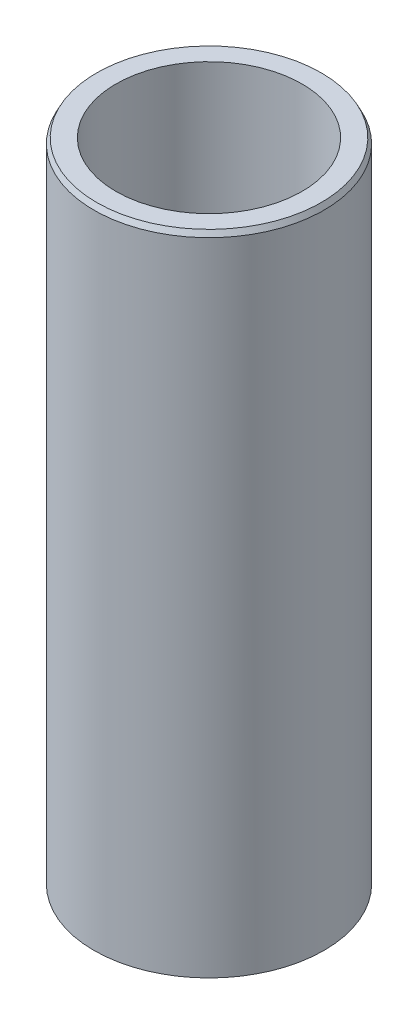
ISO-10303-21;
HEADER;
FILE_DESCRIPTION(('STEP AP214'),'2;1');
FILE_NAME('part.step','',(''),(''),'','','');
FILE_SCHEMA(('AUTOMOTIVE_DESIGN { 1 0 10303 214 1 1 1 1 }'));
ENDSEC;
DATA;
#1=APPLICATION_CONTEXT('core data for automotive mechanical design processes');
#2=APPLICATION_PROTOCOL_DEFINITION('international standard','automotive_design',2000,#1);
#3=PRODUCT_CONTEXT('',#1,'mechanical');
#4=PRODUCT('Part','Part','',(#3));
#5=PRODUCT_RELATED_PRODUCT_CATEGORY('part','',(#4));
#6=PRODUCT_DEFINITION_FORMATION('','',#4);
#7=PRODUCT_DEFINITION_CONTEXT('part definition',#1,'design');
#8=PRODUCT_DEFINITION('design','',#6,#7);
#9=PRODUCT_DEFINITION_SHAPE('','',#8);
#10=(LENGTH_UNIT() NAMED_UNIT(*) SI_UNIT(.MILLI.,.METRE.));
#11=(NAMED_UNIT(*) PLANE_ANGLE_UNIT() SI_UNIT($,.RADIAN.));
#12=(NAMED_UNIT(*) SI_UNIT($,.STERADIAN.) SOLID_ANGLE_UNIT());
#13=UNCERTAINTY_MEASURE_WITH_UNIT(LENGTH_MEASURE(1.E-05),#10,'distance_accuracy_value','');
#14=(GEOMETRIC_REPRESENTATION_CONTEXT(3) GLOBAL_UNCERTAINTY_ASSIGNED_CONTEXT((#13)) GLOBAL_UNIT_ASSIGNED_CONTEXT((#10,
#11,#12)) REPRESENTATION_CONTEXT('',''));
#15=CARTESIAN_POINT('',(0.,0.,0.));
#16=DIRECTION('',(0.,0.,1.));
#17=DIRECTION('',(1.,0.,0.));
#18=AXIS2_PLACEMENT_3D('',#15,#16,#17);
#19=CARTESIAN_POINT('',(0.,183.426677698119,0.));
#20=DIRECTION('',(0.,-1.,0.));
#21=DIRECTION('',(0.,0.,-1.));
#22=AXIS2_PLACEMENT_3D('',#19,#20,#21);
#23=CYLINDRICAL_SURFACE('',#22,32.5);
#24=CARTESIAN_POINT('',(0.,181.927394427005,0.));
#25=DIRECTION('',(0.,1.,0.));
#26=DIRECTION('',(0.,0.,1.));
#27=AXIS2_PLACEMENT_3D('',#24,#25,#26);
#28=CIRCLE('',#27,32.5);
#29=CARTESIAN_POINT('',(0.,181.927394427005,-32.5));
#30=VERTEX_POINT('',#29);
#31=EDGE_CURVE('E50',#30,#30,#28,.F.);
#32=ORIENTED_EDGE('',*,*,#31,.T.);
#33=EDGE_LOOP('',(#32));
#34=FACE_BOUND('',#33,.T.);
#35=CARTESIAN_POINT('',(0.,0.761838426538763,0.));
#36=DIRECTION('',(0.,1.,0.));
#37=DIRECTION('',(0.,0.,1.));
#38=AXIS2_PLACEMENT_3D('',#35,#36,#37);
#39=CIRCLE('',#38,32.5);
#40=CARTESIAN_POINT('',(0.,0.761838426538763,32.5));
#41=VERTEX_POINT('',#40);
#42=EDGE_CURVE('E51',#41,#41,#39,.T.);
#43=ORIENTED_EDGE('',*,*,#42,.T.);
#44=EDGE_LOOP('',(#43));
#45=FACE_BOUND('',#44,.T.);
#46=ADVANCED_FACE('F39',(#34,#45),#23,.T.);
#47=CARTESIAN_POINT('',(0.,183.426677698119,0.));
#48=DIRECTION('',(0.,1.,0.));
#49=DIRECTION('',(0.,0.,1.));
#50=AXIS2_PLACEMENT_3D('',#47,#48,#49);
#51=PLANE('',#50);
#52=CARTESIAN_POINT('',(0.,183.426677698119,0.));
#53=DIRECTION('',(0.,1.,0.));
#54=DIRECTION('',(0.,0.,1.));
#55=AXIS2_PLACEMENT_3D('',#52,#53,#54);
#56=CIRCLE('',#55,31.7381615734613);
#57=CARTESIAN_POINT('',(0.,183.426677698119,-31.7381615734613));
#58=VERTEX_POINT('',#57);
#59=EDGE_CURVE('E54',#58,#58,#56,.T.);
#60=ORIENTED_EDGE('',*,*,#59,.T.);
#61=EDGE_LOOP('',(#60));
#62=FACE_BOUND('',#61,.T.);
#63=CARTESIAN_POINT('',(0.,183.426677698119,0.));
#64=DIRECTION('',(0.,1.,0.));
#65=DIRECTION('',(0.,0.,1.));
#66=AXIS2_PLACEMENT_3D('',#63,#64,#65);
#67=CIRCLE('',#66,26.3099787280632);
#68=CARTESIAN_POINT('',(0.,183.426677698119,26.3099787280632));
#69=VERTEX_POINT('',#68);
#70=EDGE_CURVE('E58',#69,#69,#67,.T.);
#71=ORIENTED_EDGE('',*,*,#70,.F.);
#72=EDGE_LOOP('',(#71));
#73=FACE_BOUND('',#72,.T.);
#74=ADVANCED_FACE('F69',(#62,#73),#51,.T.);
#75=CARTESIAN_POINT('',(0.,0.,0.));
#76=DIRECTION('',(0.,1.,0.));
#77=DIRECTION('',(0.,0.,1.));
#78=AXIS2_PLACEMENT_3D('',#75,#76,#77);
#79=PLANE('',#78);
#80=CARTESIAN_POINT('',(0.,0.,0.));
#81=DIRECTION('',(0.,1.,0.));
#82=DIRECTION('',(0.,0.,1.));
#83=AXIS2_PLACEMENT_3D('',#80,#81,#82);
#84=CIRCLE('',#83,31.0007167288852);
#85=CARTESIAN_POINT('',(0.,0.,31.0007167288852));
#86=VERTEX_POINT('',#85);
#87=EDGE_CURVE('E10',#86,#86,#84,.F.);
#88=ORIENTED_EDGE('',*,*,#87,.T.);
#89=EDGE_LOOP('',(#88));
#90=FACE_BOUND('',#89,.T.);
#91=CARTESIAN_POINT('',(0.,0.,0.));
#92=DIRECTION('',(0.,1.,0.));
#93=DIRECTION('',(0.,0.,1.));
#94=AXIS2_PLACEMENT_3D('',#91,#92,#93);
#95=CIRCLE('',#94,26.3099787280632);
#96=CARTESIAN_POINT('',(0.,0.,26.3099787280632));
#97=VERTEX_POINT('',#96);
#98=EDGE_CURVE('E63',#97,#97,#95,.T.);
#99=ORIENTED_EDGE('',*,*,#98,.T.);
#100=EDGE_LOOP('',(#99));
#101=FACE_BOUND('',#100,.T.);
#102=ADVANCED_FACE('F75',(#90,#101),#79,.F.);
#103=CARTESIAN_POINT('',(0.,183.426677698119,0.));
#104=DIRECTION('',(0.,-1.,0.));
#105=DIRECTION('',(0.,0.,-1.));
#106=AXIS2_PLACEMENT_3D('',#103,#104,#105);
#107=CYLINDRICAL_SURFACE('',#106,26.3099787280632);
#108=ORIENTED_EDGE('',*,*,#70,.T.);
#109=EDGE_LOOP('',(#108));
#110=FACE_BOUND('',#109,.T.);
#111=ORIENTED_EDGE('',*,*,#98,.F.);
#112=EDGE_LOOP('',(#111));
#113=FACE_BOUND('',#112,.T.);
#114=ADVANCED_FACE('F70',(#110,#113),#107,.F.);
#115=CARTESIAN_POINT('',(0.,183.426677698119,0.));
#116=DIRECTION('',(0.,-1.,0.));
#117=DIRECTION('',(0.,0.,-1.));
#118=AXIS2_PLACEMENT_3D('',#115,#116,#117);
#119=CONICAL_SURFACE('',#118,31.7381615734613,0.470134474114644);
#120=CARTESIAN_POINT('',(0.,181.927394427005,-32.5));
#121=CARTESIAN_POINT('',(0.,181.943011961079,-32.4920641830569));
#122=CARTESIAN_POINT('',(0.,181.958629495153,-32.4841283661138));
#123=CARTESIAN_POINT('',(0.,181.989864563301,-32.4682567322276));
#124=CARTESIAN_POINT('',(0.,182.005482097375,-32.4603209152844));
#125=CARTESIAN_POINT('',(0.,182.036717165523,-32.4444492813982));
#126=CARTESIAN_POINT('',(0.,182.052334699597,-32.4365134644551));
#127=CARTESIAN_POINT('',(0.,182.083569767746,-32.4206418305689));
#128=CARTESIAN_POINT('',(0.,182.09918730182,-32.4127060136258));
#129=CARTESIAN_POINT('',(0.,182.130422369968,-32.3968343797396));
#130=CARTESIAN_POINT('',(0.,182.146039904042,-32.3888985627964));
#131=CARTESIAN_POINT('',(0.,182.17727497219,-32.3730269289102));
#132=CARTESIAN_POINT('',(0.,182.192892506264,-32.3650911119671));
#133=CARTESIAN_POINT('',(0.,182.224127574413,-32.3492194780809));
#134=CARTESIAN_POINT('',(0.,182.239745108487,-32.3412836611378));
#135=CARTESIAN_POINT('',(0.,182.270980176635,-32.3254120272516));
#136=CARTESIAN_POINT('',(0.,182.286597710709,-32.3174762103084));
#137=CARTESIAN_POINT('',(0.,182.317832778857,-32.3016045764222));
#138=CARTESIAN_POINT('',(0.,182.333450312931,-32.2936687594791));
#139=CARTESIAN_POINT('',(0.,182.36468538108,-32.2777971255929));
#140=CARTESIAN_POINT('',(0.,182.380302915154,-32.2698613086498));
#141=CARTESIAN_POINT('',(0.,182.411537983302,-32.2539896747635));
#142=CARTESIAN_POINT('',(0.,182.427155517376,-32.2460538578204));
#143=CARTESIAN_POINT('',(0.,182.458390585524,-32.2301822239342));
#144=CARTESIAN_POINT('',(0.,182.474008119598,-32.2222464069911));
#145=CARTESIAN_POINT('',(0.,182.505243187747,-32.2063747731049));
#146=CARTESIAN_POINT('',(0.,182.520860721821,-32.1984389561618));
#147=CARTESIAN_POINT('',(0.,182.552095789969,-32.1825673222755));
#148=CARTESIAN_POINT('',(0.,182.567713324043,-32.1746315053324));
#149=CARTESIAN_POINT('',(0.,182.598948392191,-32.1587598714462));
#150=CARTESIAN_POINT('',(0.,182.614565926266,-32.1508240545031));
#151=CARTESIAN_POINT('',(0.,182.645800994414,-32.1349524206169));
#152=CARTESIAN_POINT('',(0.,182.661418528488,-32.1270166036738));
#153=CARTESIAN_POINT('',(0.,182.692653596636,-32.1111449697875));
#154=CARTESIAN_POINT('',(0.,182.70827113071,-32.1032091528444));
#155=CARTESIAN_POINT('',(0.,182.739506198858,-32.0873375189582));
#156=CARTESIAN_POINT('',(0.,182.755123732933,-32.0794017020151));
#157=CARTESIAN_POINT('',(0.,182.786358801081,-32.0635300681289));
#158=CARTESIAN_POINT('',(0.,182.801976335155,-32.0555942511858));
#159=CARTESIAN_POINT('',(0.,182.833211403303,-32.0397226172995));
#160=CARTESIAN_POINT('',(0.,182.848828937377,-32.0317868003564));
#161=CARTESIAN_POINT('',(0.,182.880064005525,-32.0159151664702));
#162=CARTESIAN_POINT('',(0.,182.8956815396,-32.0079793495271));
#163=CARTESIAN_POINT('',(0.,182.926916607748,-31.9921077156409));
#164=CARTESIAN_POINT('',(0.,182.942534141822,-31.9841718986977));
#165=CARTESIAN_POINT('',(0.,182.97376920997,-31.9683002648115));
#166=CARTESIAN_POINT('',(0.,182.989386744044,-31.9603644478684));
#167=CARTESIAN_POINT('',(0.,183.020621812192,-31.9444928139822));
#168=CARTESIAN_POINT('',(0.,183.036239346267,-31.9365569970391));
#169=CARTESIAN_POINT('',(0.,183.067474414415,-31.9206853631529));
#170=CARTESIAN_POINT('',(0.,183.083091948489,-31.9127495462097));
#171=CARTESIAN_POINT('',(0.,183.114327016637,-31.8968779123235));
#172=CARTESIAN_POINT('',(0.,183.129944550711,-31.8889420953804));
#173=CARTESIAN_POINT('',(0.,183.161179618859,-31.8730704614942));
#174=CARTESIAN_POINT('',(0.,183.176797152934,-31.8651346445511));
#175=CARTESIAN_POINT('',(0.,183.208032221082,-31.8492630106648));
#176=CARTESIAN_POINT('',(0.,183.223649755156,-31.8413271937217));
#177=CARTESIAN_POINT('',(0.,183.254884823304,-31.8254555598355));
#178=CARTESIAN_POINT('',(0.,183.270502357378,-31.8175197428924));
#179=CARTESIAN_POINT('',(0.,183.301737425526,-31.8016481090062));
#180=CARTESIAN_POINT('',(0.,183.317354959601,-31.7937122920631));
#181=CARTESIAN_POINT('',(0.,183.348590027749,-31.7778406581768));
#182=CARTESIAN_POINT('',(0.,183.364207561823,-31.7699048412337));
#183=CARTESIAN_POINT('',(0.,183.395442629971,-31.7540332073475));
#184=CARTESIAN_POINT('',(0.,183.411060164045,-31.7460973904044));
#185=CARTESIAN_POINT('',(0.,183.426677698119,-31.7381615734613));
#186=B_SPLINE_CURVE_WITH_KNOTS('',3,(#120,#121,#122,#123,#124,#125,#126,#127,#128,#129,#130,
#131,#132,#133,#134,#135,#136,#137,#138,#139,#140,#141,#142,#143,#144,#145,#146,#147,#148,#149,
#150,#151,#152,#153,#154,#155,#156,#157,#158,#159,#160,#161,#162,#163,#164,#165,#166,#167,#168,
#169,#170,#171,#172,#173,#174,#175,#176,#177,#178,#179,#180,#181,#182,#183,#184,#185),
.UNSPECIFIED.,.F.,.F.,(4,2,2,2,2,2,2,2,2,2,2,2,2,2,2,2,2,2,2,2,2,2,2,2,2,2,2,2,2,2,2,2,4),(0.,
0.0525543628064641,0.105108725612956,0.157663088419445,0.210217451225934,0.262771814032426,
0.31532617683889,0.367880539645379,0.420434902451868,0.47298926525836,0.525543628064848,
0.578097990871313,0.630652353677804,0.683206716484293,0.735761079290782,0.788315442097274,
0.840869804903763,0.893424167710227,0.945978530516719,0.998532893323208,1.0510872561297,
1.10364161893619,1.15619598174265,1.20875034454914,1.26130470735563,1.31385907016212,
1.36641343296861,1.41896779577508,1.47152215858157,1.52407652138806,1.57663088419455,
1.62918524700104,1.68173960980753),.UNSPECIFIED.);
#187=EDGE_CURVE('BSEAM81',#30,#58,#186,.T.);
#188=ORIENTED_EDGE('',*,*,#31,.F.);
#189=ORIENTED_EDGE('',*,*,#59,.F.);
#190=ORIENTED_EDGE('',*,*,#187,.T.);
#191=ORIENTED_EDGE('',*,*,#187,.F.);
#192=EDGE_LOOP('',(#188,#190,#189,#191));
#193=FACE_BOUND('',#192,.T.);
#194=ADVANCED_FACE('F81',(#193),#119,.T.);
#195=CARTESIAN_POINT('',(0.,0.761838426538763,0.));
#196=DIRECTION('',(0.,1.,0.));
#197=DIRECTION('',(0.,0.,1.));
#198=AXIS2_PLACEMENT_3D('',#195,#196,#197);
#199=CONICAL_SURFACE('',#198,32.5,1.10066185268025);
#200=ORIENTED_EDGE('',*,*,#87,.F.);
#201=EDGE_LOOP('',(#200));
#202=FACE_BOUND('',#201,.T.);
#203=ORIENTED_EDGE('',*,*,#42,.F.);
#204=EDGE_LOOP('',(#203));
#205=FACE_BOUND('',#204,.T.);
#206=ADVANCED_FACE('F45',(#202,#205),#199,.T.);
#207=CLOSED_SHELL('',(#46,#74,#102,#114,#194,#206));
#208=MANIFOLD_SOLID_BREP('B2',#207);
#209=ADVANCED_BREP_SHAPE_REPRESENTATION('',(#18,#208),#14);
#210=SHAPE_DEFINITION_REPRESENTATION(#9,#209);
ENDSEC;
END-ISO-10303-21;
